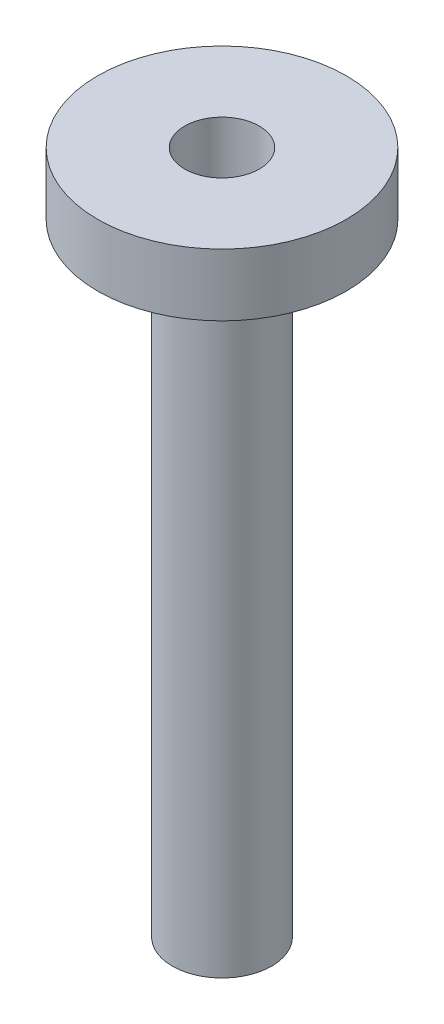
ISO-10303-21;
HEADER;
FILE_DESCRIPTION(('STEP AP214'),'2;1');
FILE_NAME('part.step','',(''),(''),'','','');
FILE_SCHEMA(('AUTOMOTIVE_DESIGN { 1 0 10303 214 1 1 1 1 }'));
ENDSEC;
DATA;
#1=APPLICATION_CONTEXT('core data for automotive mechanical design processes');
#2=APPLICATION_PROTOCOL_DEFINITION('international standard','automotive_design',2000,#1);
#3=PRODUCT_CONTEXT('',#1,'mechanical');
#4=PRODUCT('Part','Part','',(#3));
#5=PRODUCT_RELATED_PRODUCT_CATEGORY('part','',(#4));
#6=PRODUCT_DEFINITION_FORMATION('','',#4);
#7=PRODUCT_DEFINITION_CONTEXT('part definition',#1,'design');
#8=PRODUCT_DEFINITION('design','',#6,#7);
#9=PRODUCT_DEFINITION_SHAPE('','',#8);
#10=(LENGTH_UNIT() NAMED_UNIT(*) SI_UNIT(.MILLI.,.METRE.));
#11=(NAMED_UNIT(*) PLANE_ANGLE_UNIT() SI_UNIT($,.RADIAN.));
#12=(NAMED_UNIT(*) SI_UNIT($,.STERADIAN.) SOLID_ANGLE_UNIT());
#13=UNCERTAINTY_MEASURE_WITH_UNIT(LENGTH_MEASURE(1.E-05),#10,'distance_accuracy_value','');
#14=(GEOMETRIC_REPRESENTATION_CONTEXT(3) GLOBAL_UNCERTAINTY_ASSIGNED_CONTEXT((#13)) GLOBAL_UNIT_ASSIGNED_CONTEXT((#10,
#11,#12)) REPRESENTATION_CONTEXT('',''));
#15=CARTESIAN_POINT('',(0.,0.,0.));
#16=DIRECTION('',(0.,0.,1.));
#17=DIRECTION('',(1.,0.,0.));
#18=AXIS2_PLACEMENT_3D('',#15,#16,#17);
#19=CARTESIAN_POINT('',(0.,0.,0.));
#20=DIRECTION('',(0.,1.,0.));
#21=DIRECTION('',(0.,0.,1.));
#22=AXIS2_PLACEMENT_3D('',#19,#20,#21);
#23=CYLINDRICAL_SURFACE('',#22,12.7);
#24=CARTESIAN_POINT('',(0.,-6.35,0.));
#25=DIRECTION('',(0.,1.,0.));
#26=DIRECTION('',(0.,0.,1.));
#27=AXIS2_PLACEMENT_3D('',#24,#25,#26);
#28=CIRCLE('',#27,12.7);
#29=CARTESIAN_POINT('',(0.,-6.35,12.7));
#30=VERTEX_POINT('',#29);
#31=EDGE_CURVE('E10',#30,#30,#28,.T.);
#32=ORIENTED_EDGE('',*,*,#31,.T.);
#33=EDGE_LOOP('',(#32));
#34=FACE_BOUND('',#33,.T.);
#35=CARTESIAN_POINT('',(0.,0.,0.));
#36=DIRECTION('',(0.,1.,0.));
#37=DIRECTION('',(0.,0.,1.));
#38=AXIS2_PLACEMENT_3D('',#35,#36,#37);
#39=CIRCLE('',#38,12.7);
#40=CARTESIAN_POINT('',(0.,0.,12.7));
#41=VERTEX_POINT('',#40);
#42=EDGE_CURVE('E80',#41,#41,#39,.T.);
#43=ORIENTED_EDGE('',*,*,#42,.F.);
#44=EDGE_LOOP('',(#43));
#45=FACE_BOUND('',#44,.T.);
#46=ADVANCED_FACE('F37',(#34,#45),#23,.T.);
#47=CARTESIAN_POINT('',(-12.7,-6.35,0.));
#48=DIRECTION('',(0.,-1.,0.));
#49=DIRECTION('',(0.,0.,-1.));
#50=AXIS2_PLACEMENT_3D('',#47,#48,#49);
#51=PLANE('',#50);
#52=CARTESIAN_POINT('',(0.,-6.35,0.));
#53=DIRECTION('',(0.,1.,0.));
#54=DIRECTION('',(0.,0.,1.));
#55=AXIS2_PLACEMENT_3D('',#52,#53,#54);
#56=CIRCLE('',#55,11.1125);
#57=CARTESIAN_POINT('',(0.,-6.35,11.1125));
#58=VERTEX_POINT('',#57);
#59=EDGE_CURVE('E44',#58,#58,#56,.T.);
#60=ORIENTED_EDGE('',*,*,#59,.T.);
#61=EDGE_LOOP('',(#60));
#62=FACE_BOUND('',#61,.T.);
#63=ORIENTED_EDGE('',*,*,#31,.F.);
#64=EDGE_LOOP('',(#63));
#65=FACE_BOUND('',#64,.T.);
#66=ADVANCED_FACE('F89',(#62,#65),#51,.T.);
#67=CARTESIAN_POINT('',(0.,0.,0.));
#68=DIRECTION('',(0.,1.,0.));
#69=DIRECTION('',(0.,0.,1.));
#70=AXIS2_PLACEMENT_3D('',#67,#68,#69);
#71=CYLINDRICAL_SURFACE('',#70,11.1125);
#72=CARTESIAN_POINT('',(0.,-4.318,0.));
#73=DIRECTION('',(0.,1.,0.));
#74=DIRECTION('',(0.,0.,1.));
#75=AXIS2_PLACEMENT_3D('',#72,#73,#74);
#76=CIRCLE('',#75,11.1125);
#77=CARTESIAN_POINT('',(0.,-4.318,11.1125));
#78=VERTEX_POINT('',#77);
#79=EDGE_CURVE('E49',#78,#78,#76,.T.);
#80=ORIENTED_EDGE('',*,*,#79,.T.);
#81=EDGE_LOOP('',(#80));
#82=FACE_BOUND('',#81,.T.);
#83=ORIENTED_EDGE('',*,*,#59,.F.);
#84=EDGE_LOOP('',(#83));
#85=FACE_BOUND('',#84,.T.);
#86=ADVANCED_FACE('F93',(#82,#85),#71,.F.);
#87=CARTESIAN_POINT('',(-11.1125,-4.318,0.));
#88=DIRECTION('',(0.,-1.,0.));
#89=DIRECTION('',(0.,0.,-1.));
#90=AXIS2_PLACEMENT_3D('',#87,#88,#89);
#91=PLANE('',#90);
#92=CARTESIAN_POINT('',(0.,-4.318,0.));
#93=DIRECTION('',(0.,1.,0.));
#94=DIRECTION('',(0.,0.,1.));
#95=AXIS2_PLACEMENT_3D('',#92,#93,#94);
#96=CIRCLE('',#95,8.0645);
#97=CARTESIAN_POINT('',(0.,-4.318,8.0645));
#98=VERTEX_POINT('',#97);
#99=EDGE_CURVE('E54',#98,#98,#96,.T.);
#100=ORIENTED_EDGE('',*,*,#99,.T.);
#101=EDGE_LOOP('',(#100));
#102=FACE_BOUND('',#101,.T.);
#103=ORIENTED_EDGE('',*,*,#79,.F.);
#104=EDGE_LOOP('',(#103));
#105=FACE_BOUND('',#104,.T.);
#106=ADVANCED_FACE('F97',(#102,#105),#91,.T.);
#107=CARTESIAN_POINT('',(0.,0.,0.));
#108=DIRECTION('',(0.,1.,0.));
#109=DIRECTION('',(0.,0.,1.));
#110=AXIS2_PLACEMENT_3D('',#107,#108,#109);
#111=CYLINDRICAL_SURFACE('',#110,8.0645);
#112=CARTESIAN_POINT('',(0.,-6.35,0.));
#113=DIRECTION('',(0.,1.,0.));
#114=DIRECTION('',(0.,0.,1.));
#115=AXIS2_PLACEMENT_3D('',#112,#113,#114);
#116=CIRCLE('',#115,8.0645);
#117=CARTESIAN_POINT('',(0.,-6.35,8.0645));
#118=VERTEX_POINT('',#117);
#119=EDGE_CURVE('E60',#118,#118,#116,.T.);
#120=ORIENTED_EDGE('',*,*,#119,.T.);
#121=EDGE_LOOP('',(#120));
#122=FACE_BOUND('',#121,.T.);
#123=ORIENTED_EDGE('',*,*,#99,.F.);
#124=EDGE_LOOP('',(#123));
#125=FACE_BOUND('',#124,.T.);
#126=ADVANCED_FACE('F104',(#122,#125),#111,.T.);
#127=CARTESIAN_POINT('',(-8.0645,-6.35,0.));
#128=DIRECTION('',(0.,-1.,0.));
#129=DIRECTION('',(0.,0.,-1.));
#130=AXIS2_PLACEMENT_3D('',#127,#128,#129);
#131=PLANE('',#130);
#132=CARTESIAN_POINT('',(0.,-6.35,0.));
#133=DIRECTION('',(0.,1.,0.));
#134=DIRECTION('',(0.,0.,1.));
#135=AXIS2_PLACEMENT_3D('',#132,#133,#134);
#136=CIRCLE('',#135,5.08);
#137=CARTESIAN_POINT('',(0.,-6.35,5.08));
#138=VERTEX_POINT('',#137);
#139=EDGE_CURVE('E64',#138,#138,#136,.T.);
#140=ORIENTED_EDGE('',*,*,#139,.T.);
#141=EDGE_LOOP('',(#140));
#142=FACE_BOUND('',#141,.T.);
#143=ORIENTED_EDGE('',*,*,#119,.F.);
#144=EDGE_LOOP('',(#143));
#145=FACE_BOUND('',#144,.T.);
#146=ADVANCED_FACE('F108',(#142,#145),#131,.T.);
#147=CARTESIAN_POINT('',(0.,0.,0.));
#148=DIRECTION('',(0.,1.,0.));
#149=DIRECTION('',(0.,0.,1.));
#150=AXIS2_PLACEMENT_3D('',#147,#148,#149);
#151=CYLINDRICAL_SURFACE('',#150,5.07999999999999);
#152=CARTESIAN_POINT('',(0.,-69.85,0.));
#153=DIRECTION('',(0.,1.,0.));
#154=DIRECTION('',(0.,0.,1.));
#155=AXIS2_PLACEMENT_3D('',#152,#153,#154);
#156=CIRCLE('',#155,5.07999999999999);
#157=CARTESIAN_POINT('',(0.,-69.85,5.07999999999999));
#158=VERTEX_POINT('',#157);
#159=EDGE_CURVE('E68',#158,#158,#156,.T.);
#160=ORIENTED_EDGE('',*,*,#159,.T.);
#161=EDGE_LOOP('',(#160));
#162=FACE_BOUND('',#161,.T.);
#163=ORIENTED_EDGE('',*,*,#139,.F.);
#164=EDGE_LOOP('',(#163));
#165=FACE_BOUND('',#164,.T.);
#166=ADVANCED_FACE('F112',(#162,#165),#151,.T.);
#167=CARTESIAN_POINT('',(0.,-69.85,0.));
#168=DIRECTION('',(0.,-1.,0.));
#169=DIRECTION('',(0.,0.,-1.));
#170=AXIS2_PLACEMENT_3D('',#167,#168,#169);
#171=CONICAL_SURFACE('',#170,5.07999999999999,0.785398163397442);
#172=CARTESIAN_POINT('',(0.,-68.58,0.));
#173=DIRECTION('',(0.,1.,0.));
#174=DIRECTION('',(0.,0.,1.));
#175=AXIS2_PLACEMENT_3D('',#172,#173,#174);
#176=CIRCLE('',#175,3.81);
#177=CARTESIAN_POINT('',(0.,-68.58,3.81));
#178=VERTEX_POINT('',#177);
#179=EDGE_CURVE('E72',#178,#178,#176,.T.);
#180=ORIENTED_EDGE('',*,*,#179,.T.);
#181=EDGE_LOOP('',(#180));
#182=FACE_BOUND('',#181,.T.);
#183=ORIENTED_EDGE('',*,*,#159,.F.);
#184=EDGE_LOOP('',(#183));
#185=FACE_BOUND('',#184,.T.);
#186=ADVANCED_FACE('F116',(#182,#185),#171,.F.);
#187=CARTESIAN_POINT('',(0.,0.,0.));
#188=DIRECTION('',(0.,1.,0.));
#189=DIRECTION('',(0.,0.,1.));
#190=AXIS2_PLACEMENT_3D('',#187,#188,#189);
#191=CYLINDRICAL_SURFACE('',#190,3.81);
#192=CARTESIAN_POINT('',(0.,0.,0.));
#193=DIRECTION('',(0.,1.,0.));
#194=DIRECTION('',(0.,0.,1.));
#195=AXIS2_PLACEMENT_3D('',#192,#193,#194);
#196=CIRCLE('',#195,3.81);
#197=CARTESIAN_POINT('',(0.,0.,3.81));
#198=VERTEX_POINT('',#197);
#199=EDGE_CURVE('E76',#198,#198,#196,.T.);
#200=ORIENTED_EDGE('',*,*,#199,.T.);
#201=EDGE_LOOP('',(#200));
#202=FACE_BOUND('',#201,.T.);
#203=ORIENTED_EDGE('',*,*,#179,.F.);
#204=EDGE_LOOP('',(#203));
#205=FACE_BOUND('',#204,.T.);
#206=ADVANCED_FACE('F120',(#202,#205),#191,.F.);
#207=CARTESIAN_POINT('',(-3.81,0.,0.));
#208=DIRECTION('',(0.,1.,0.));
#209=DIRECTION('',(0.,0.,1.));
#210=AXIS2_PLACEMENT_3D('',#207,#208,#209);
#211=PLANE('',#210);
#212=ORIENTED_EDGE('',*,*,#42,.T.);
#213=EDGE_LOOP('',(#212));
#214=FACE_BOUND('',#213,.T.);
#215=ORIENTED_EDGE('',*,*,#199,.F.);
#216=EDGE_LOOP('',(#215));
#217=FACE_BOUND('',#216,.T.);
#218=ADVANCED_FACE('F85',(#214,#217),#211,.T.);
#219=CLOSED_SHELL('',(#46,#66,#86,#106,#126,#146,#166,#186,#206,#218));
#220=MANIFOLD_SOLID_BREP('B2',#219);
#221=ADVANCED_BREP_SHAPE_REPRESENTATION('',(#18,#220),#14);
#222=SHAPE_DEFINITION_REPRESENTATION(#9,#221);
ENDSEC;
END-ISO-10303-21;
